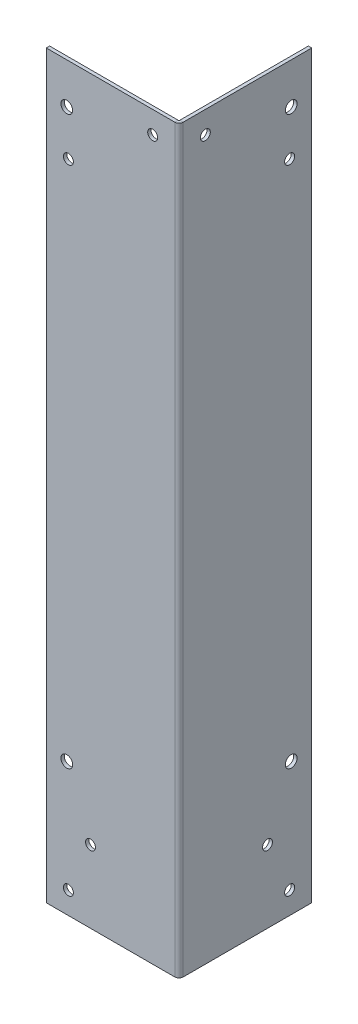
ISO-10303-21;
HEADER;
FILE_DESCRIPTION(('STEP AP214'),'2;1');
FILE_NAME('part.step','',(''),(''),'','','');
FILE_SCHEMA(('AUTOMOTIVE_DESIGN { 1 0 10303 214 1 1 1 1 }'));
ENDSEC;
DATA;
#1=APPLICATION_CONTEXT('core data for automotive mechanical design processes');
#2=APPLICATION_PROTOCOL_DEFINITION('international standard','automotive_design',2000,#1);
#3=PRODUCT_CONTEXT('',#1,'mechanical');
#4=PRODUCT('Part','Part','',(#3));
#5=PRODUCT_RELATED_PRODUCT_CATEGORY('part','',(#4));
#6=PRODUCT_DEFINITION_FORMATION('','',#4);
#7=PRODUCT_DEFINITION_CONTEXT('part definition',#1,'design');
#8=PRODUCT_DEFINITION('design','',#6,#7);
#9=PRODUCT_DEFINITION_SHAPE('','',#8);
#10=(LENGTH_UNIT() NAMED_UNIT(*) SI_UNIT(.MILLI.,.METRE.));
#11=(NAMED_UNIT(*) PLANE_ANGLE_UNIT() SI_UNIT($,.RADIAN.));
#12=(NAMED_UNIT(*) SI_UNIT($,.STERADIAN.) SOLID_ANGLE_UNIT());
#13=UNCERTAINTY_MEASURE_WITH_UNIT(LENGTH_MEASURE(1.E-05),#10,'distance_accuracy_value','');
#14=(GEOMETRIC_REPRESENTATION_CONTEXT(3) GLOBAL_UNCERTAINTY_ASSIGNED_CONTEXT((#13)) GLOBAL_UNIT_ASSIGNED_CONTEXT((#10,
#11,#12)) REPRESENTATION_CONTEXT('',''));
#15=CARTESIAN_POINT('',(0.,0.,0.));
#16=DIRECTION('',(0.,0.,1.));
#17=DIRECTION('',(1.,0.,0.));
#18=AXIS2_PLACEMENT_3D('',#15,#16,#17);
#19=CARTESIAN_POINT('',(-1.51892,334.61392,0.));
#20=DIRECTION('',(0.,1.,0.));
#21=DIRECTION('',(0.,0.,1.));
#22=AXIS2_PLACEMENT_3D('',#19,#20,#21);
#23=PLANE('',#22);
#24=DIRECTION('',(0.,0.,1.));
#25=VECTOR('',#24,1.);
#26=CARTESIAN_POINT('',(-1.51892,334.61392,0.));
#27=LINE('',#26,#25);
#28=CARTESIAN_POINT('',(-1.51892,334.61392,0.));
#29=VERTEX_POINT('',#28);
#30=CARTESIAN_POINT('',(-1.51891999999999,334.61392,58.10008));
#31=VERTEX_POINT('',#30);
#32=EDGE_CURVE('E118',#29,#31,#27,.T.);
#33=ORIENTED_EDGE('',*,*,#32,.T.);
#34=DIRECTION('',(1.,0.,0.));
#35=VECTOR('',#34,1.);
#36=CARTESIAN_POINT('',(-1.51891999999999,334.61392,58.10008));
#37=LINE('',#36,#35);
#38=CARTESIAN_POINT('',(0.,334.61392,58.10008));
#39=VERTEX_POINT('',#38);
#40=EDGE_CURVE('E114',#31,#39,#37,.T.);
#41=ORIENTED_EDGE('',*,*,#40,.T.);
#42=DIRECTION('',(0.,0.,1.));
#43=VECTOR('',#42,1.);
#44=CARTESIAN_POINT('',(0.,334.61392,0.));
#45=LINE('',#44,#43);
#46=CARTESIAN_POINT('',(0.,334.61392,0.));
#47=VERTEX_POINT('',#46);
#48=EDGE_CURVE('E104',#47,#39,#45,.T.);
#49=ORIENTED_EDGE('',*,*,#48,.F.);
#50=DIRECTION('',(1.,0.,0.));
#51=VECTOR('',#50,1.);
#52=CARTESIAN_POINT('',(-1.51892,334.61392,0.));
#53=LINE('',#52,#51);
#54=EDGE_CURVE('E63',#29,#47,#53,.T.);
#55=ORIENTED_EDGE('',*,*,#54,.F.);
#56=EDGE_LOOP('',(#33,#41,#49,#55));
#57=FACE_BOUND('',#56,.T.);
#58=ADVANCED_FACE('F59',(#57),#23,.T.);
#59=CARTESIAN_POINT('',(-1.51892,0.,0.));
#60=DIRECTION('',(1.,0.,0.));
#61=DIRECTION('',(0.,0.,-1.));
#62=AXIS2_PLACEMENT_3D('',#59,#60,#61);
#63=PLANE('',#62);
#64=CARTESIAN_POINT('',(-1.51892,296.132840000001,10.));
#65=DIRECTION('',(1.,0.,0.));
#66=DIRECTION('',(0.,0.,-1.));
#67=AXIS2_PLACEMENT_3D('',#64,#65,#66);
#68=CIRCLE('',#67,2.24999999999997);
#69=CARTESIAN_POINT('',(-1.51892,296.132840000001,7.75000000000003));
#70=VERTEX_POINT('',#69);
#71=EDGE_CURVE('E239',#70,#70,#68,.T.);
#72=ORIENTED_EDGE('',*,*,#71,.T.);
#73=EDGE_LOOP('',(#72));
#74=FACE_BOUND('',#73,.T.);
#75=CARTESIAN_POINT('',(-1.51892,324.61392,48.10008));
#76=DIRECTION('',(1.,0.,0.));
#77=DIRECTION('',(0.,0.,-1.));
#78=AXIS2_PLACEMENT_3D('',#75,#76,#77);
#79=CIRCLE('',#78,2.24999999999997);
#80=CARTESIAN_POINT('',(-1.51892,324.61392,45.85008));
#81=VERTEX_POINT('',#80);
#82=EDGE_CURVE('E233',#81,#81,#79,.T.);
#83=ORIENTED_EDGE('',*,*,#82,.T.);
#84=EDGE_LOOP('',(#83));
#85=FACE_BOUND('',#84,.T.);
#86=CARTESIAN_POINT('',(-1.51892,10.,10.));
#87=DIRECTION('',(1.,0.,0.));
#88=DIRECTION('',(0.,0.,-1.));
#89=AXIS2_PLACEMENT_3D('',#86,#87,#88);
#90=CIRCLE('',#89,2.24999999999999);
#91=CARTESIAN_POINT('',(-1.51892,10.,7.75000000000001));
#92=VERTEX_POINT('',#91);
#93=EDGE_CURVE('E227',#92,#92,#90,.T.);
#94=ORIENTED_EDGE('',*,*,#93,.T.);
#95=EDGE_LOOP('',(#94));
#96=FACE_BOUND('',#95,.T.);
#97=CARTESIAN_POINT('',(-1.51892,32.7140000000022,20.));
#98=DIRECTION('',(1.,0.,0.));
#99=DIRECTION('',(0.,0.,-1.));
#100=AXIS2_PLACEMENT_3D('',#97,#98,#99);
#101=CIRCLE('',#100,2.24999999999999);
#102=CARTESIAN_POINT('',(-1.51892,32.7140000000022,17.75));
#103=VERTEX_POINT('',#102);
#104=EDGE_CURVE('E221',#103,#103,#101,.T.);
#105=ORIENTED_EDGE('',*,*,#104,.T.);
#106=EDGE_LOOP('',(#105));
#107=FACE_BOUND('',#106,.T.);
#108=CARTESIAN_POINT('',(-1.51892,60.,9.273973));
#109=DIRECTION('',(1.,0.,0.));
#110=DIRECTION('',(0.,0.,-1.));
#111=AXIS2_PLACEMENT_3D('',#108,#109,#110);
#112=CIRCLE('',#111,2.64999999999999);
#113=CARTESIAN_POINT('',(-1.51892,60.,6.62397300000001));
#114=VERTEX_POINT('',#113);
#115=EDGE_CURVE('E191',#114,#114,#112,.T.);
#116=ORIENTED_EDGE('',*,*,#115,.T.);
#117=EDGE_LOOP('',(#116));
#118=FACE_BOUND('',#117,.T.);
#119=CARTESIAN_POINT('',(-1.51892,316.13284,9.273973));
#120=DIRECTION('',(1.,0.,0.));
#121=DIRECTION('',(0.,0.,-1.));
#122=AXIS2_PLACEMENT_3D('',#119,#120,#121);
#123=CIRCLE('',#122,2.64999999999999);
#124=CARTESIAN_POINT('',(-1.51892,316.13284,6.62397300000001));
#125=VERTEX_POINT('',#124);
#126=EDGE_CURVE('E185',#125,#125,#123,.T.);
#127=ORIENTED_EDGE('',*,*,#126,.T.);
#128=EDGE_LOOP('',(#127));
#129=FACE_BOUND('',#128,.T.);
#130=DIRECTION('',(0.,1.,0.));
#131=VECTOR('',#130,1.);
#132=CARTESIAN_POINT('',(-1.51891999999999,334.61392,58.10008));
#133=LINE('',#132,#131);
#134=CARTESIAN_POINT('',(-1.51891999999999,0.,58.10008));
#135=VERTEX_POINT('',#134);
#136=EDGE_CURVE('E127',#31,#135,#133,.F.);
#137=ORIENTED_EDGE('',*,*,#136,.F.);
#138=ORIENTED_EDGE('',*,*,#32,.F.);
#139=DIRECTION('',(0.,1.,0.));
#140=VECTOR('',#139,1.);
#141=CARTESIAN_POINT('',(-1.51892,0.,0.));
#142=LINE('',#141,#140);
#143=CARTESIAN_POINT('',(-1.51892,0.,0.));
#144=VERTEX_POINT('',#143);
#145=EDGE_CURVE('E103',#144,#29,#142,.T.);
#146=ORIENTED_EDGE('',*,*,#145,.F.);
#147=DIRECTION('',(0.,0.,-1.));
#148=VECTOR('',#147,1.);
#149=CARTESIAN_POINT('',(-1.51892,0.,0.));
#150=LINE('',#149,#148);
#151=EDGE_CURVE('E82',#135,#144,#150,.T.);
#152=ORIENTED_EDGE('',*,*,#151,.F.);
#153=EDGE_LOOP('',(#137,#138,#146,#152));
#154=FACE_BOUND('',#153,.T.);
#155=ADVANCED_FACE('F251',(#74,#85,#96,#107,#118,#129,#154),#63,.F.);
#156=CARTESIAN_POINT('',(0.,0.,0.));
#157=DIRECTION('',(1.,0.,0.));
#158=DIRECTION('',(0.,0.,-1.));
#159=AXIS2_PLACEMENT_3D('',#156,#157,#158);
#160=PLANE('',#159);
#161=CARTESIAN_POINT('',(0.,296.132840000001,10.));
#162=DIRECTION('',(1.,0.,0.));
#163=DIRECTION('',(0.,0.,-1.));
#164=AXIS2_PLACEMENT_3D('',#161,#162,#163);
#165=CIRCLE('',#164,2.24999999999997);
#166=CARTESIAN_POINT('',(0.,296.132840000001,7.75000000000003));
#167=VERTEX_POINT('',#166);
#168=EDGE_CURVE('E242',#167,#167,#165,.T.);
#169=ORIENTED_EDGE('',*,*,#168,.F.);
#170=EDGE_LOOP('',(#169));
#171=FACE_BOUND('',#170,.T.);
#172=CARTESIAN_POINT('',(0.,324.61392,48.10008));
#173=DIRECTION('',(1.,0.,0.));
#174=DIRECTION('',(0.,0.,-1.));
#175=AXIS2_PLACEMENT_3D('',#172,#173,#174);
#176=CIRCLE('',#175,2.24999999999997);
#177=CARTESIAN_POINT('',(0.,324.61392,45.85008));
#178=VERTEX_POINT('',#177);
#179=EDGE_CURVE('E236',#178,#178,#176,.T.);
#180=ORIENTED_EDGE('',*,*,#179,.F.);
#181=EDGE_LOOP('',(#180));
#182=FACE_BOUND('',#181,.T.);
#183=CARTESIAN_POINT('',(0.,10.,10.));
#184=DIRECTION('',(1.,0.,0.));
#185=DIRECTION('',(0.,0.,-1.));
#186=AXIS2_PLACEMENT_3D('',#183,#184,#185);
#187=CIRCLE('',#186,2.24999999999999);
#188=CARTESIAN_POINT('',(0.,10.,7.75000000000001));
#189=VERTEX_POINT('',#188);
#190=EDGE_CURVE('E230',#189,#189,#187,.T.);
#191=ORIENTED_EDGE('',*,*,#190,.F.);
#192=EDGE_LOOP('',(#191));
#193=FACE_BOUND('',#192,.T.);
#194=CARTESIAN_POINT('',(0.,32.7140000000022,20.));
#195=DIRECTION('',(1.,0.,0.));
#196=DIRECTION('',(0.,0.,-1.));
#197=AXIS2_PLACEMENT_3D('',#194,#195,#196);
#198=CIRCLE('',#197,2.24999999999999);
#199=CARTESIAN_POINT('',(0.,32.7140000000022,17.75));
#200=VERTEX_POINT('',#199);
#201=EDGE_CURVE('E224',#200,#200,#198,.T.);
#202=ORIENTED_EDGE('',*,*,#201,.F.);
#203=EDGE_LOOP('',(#202));
#204=FACE_BOUND('',#203,.T.);
#205=CARTESIAN_POINT('',(0.,60.,9.273973));
#206=DIRECTION('',(1.,0.,0.));
#207=DIRECTION('',(0.,0.,-1.));
#208=AXIS2_PLACEMENT_3D('',#205,#206,#207);
#209=CIRCLE('',#208,2.64999999999999);
#210=CARTESIAN_POINT('',(0.,60.,6.62397300000001));
#211=VERTEX_POINT('',#210);
#212=EDGE_CURVE('E194',#211,#211,#209,.T.);
#213=ORIENTED_EDGE('',*,*,#212,.F.);
#214=EDGE_LOOP('',(#213));
#215=FACE_BOUND('',#214,.T.);
#216=CARTESIAN_POINT('',(0.,316.13284,9.273973));
#217=DIRECTION('',(1.,0.,0.));
#218=DIRECTION('',(0.,0.,-1.));
#219=AXIS2_PLACEMENT_3D('',#216,#217,#218);
#220=CIRCLE('',#219,2.64999999999999);
#221=CARTESIAN_POINT('',(0.,316.13284,6.62397300000001));
#222=VERTEX_POINT('',#221);
#223=EDGE_CURVE('E188',#222,#222,#220,.T.);
#224=ORIENTED_EDGE('',*,*,#223,.F.);
#225=EDGE_LOOP('',(#224));
#226=FACE_BOUND('',#225,.T.);
#227=ORIENTED_EDGE('',*,*,#48,.T.);
#228=DIRECTION('',(0.,1.,0.));
#229=VECTOR('',#228,1.);
#230=CARTESIAN_POINT('',(0.,334.61392,58.10008));
#231=LINE('',#230,#229);
#232=CARTESIAN_POINT('',(0.,0.,58.10008));
#233=VERTEX_POINT('',#232);
#234=EDGE_CURVE('E102',#39,#233,#231,.F.);
#235=ORIENTED_EDGE('',*,*,#234,.T.);
#236=DIRECTION('',(0.,0.,-1.));
#237=VECTOR('',#236,1.);
#238=CARTESIAN_POINT('',(0.,0.,0.));
#239=LINE('',#238,#237);
#240=CARTESIAN_POINT('',(0.,0.,0.));
#241=VERTEX_POINT('',#240);
#242=EDGE_CURVE('E97',#233,#241,#239,.T.);
#243=ORIENTED_EDGE('',*,*,#242,.T.);
#244=DIRECTION('',(0.,1.,0.));
#245=VECTOR('',#244,1.);
#246=CARTESIAN_POINT('',(0.,0.,0.));
#247=LINE('',#246,#245);
#248=EDGE_CURVE('E101',#241,#47,#247,.T.);
#249=ORIENTED_EDGE('',*,*,#248,.T.);
#250=EDGE_LOOP('',(#227,#235,#243,#249));
#251=FACE_BOUND('',#250,.T.);
#252=ADVANCED_FACE('F99',(#171,#182,#193,#204,#215,#226,#251),#160,.T.);
#253=CARTESIAN_POINT('',(-1.51892,0.,0.));
#254=DIRECTION('',(0.,0.,-1.));
#255=DIRECTION('',(-1.,0.,0.));
#256=AXIS2_PLACEMENT_3D('',#253,#254,#255);
#257=PLANE('',#256);
#258=ORIENTED_EDGE('',*,*,#248,.F.);
#259=DIRECTION('',(1.,0.,0.));
#260=VECTOR('',#259,1.);
#261=CARTESIAN_POINT('',(-1.51892,0.,0.));
#262=LINE('',#261,#260);
#263=EDGE_CURVE('E13',#144,#241,#262,.T.);
#264=ORIENTED_EDGE('',*,*,#263,.F.);
#265=ORIENTED_EDGE('',*,*,#145,.T.);
#266=ORIENTED_EDGE('',*,*,#54,.T.);
#267=EDGE_LOOP('',(#258,#264,#265,#266));
#268=FACE_BOUND('',#267,.T.);
#269=ADVANCED_FACE('F61',(#268),#257,.T.);
#270=CARTESIAN_POINT('',(-1.51892,0.,0.));
#271=DIRECTION('',(0.,-1.,0.));
#272=DIRECTION('',(0.,0.,-1.));
#273=AXIS2_PLACEMENT_3D('',#270,#271,#272);
#274=PLANE('',#273);
#275=DIRECTION('',(1.,0.,0.));
#276=VECTOR('',#275,1.);
#277=CARTESIAN_POINT('',(-1.51891999999999,0.,58.10008));
#278=LINE('',#277,#276);
#279=EDGE_CURVE('E111',#135,#233,#278,.T.);
#280=ORIENTED_EDGE('',*,*,#279,.F.);
#281=ORIENTED_EDGE('',*,*,#151,.T.);
#282=ORIENTED_EDGE('',*,*,#263,.T.);
#283=ORIENTED_EDGE('',*,*,#242,.F.);
#284=EDGE_LOOP('',(#280,#281,#282,#283));
#285=FACE_BOUND('',#284,.T.);
#286=ADVANCED_FACE('F106',(#285),#274,.T.);
#287=CARTESIAN_POINT('',(-1.89991999999999,0.,58.10008));
#288=DIRECTION('',(0.,-1.,0.));
#289=DIRECTION('',(0.,0.,-1.));
#290=AXIS2_PLACEMENT_3D('',#287,#288,#289);
#291=PLANE('',#290);
#292=DIRECTION('',(0.,0.,-1.));
#293=VECTOR('',#292,1.);
#294=CARTESIAN_POINT('',(-1.89992,0.,60.));
#295=LINE('',#294,#293);
#296=CARTESIAN_POINT('',(-1.89991999999999,0.,58.48108));
#297=VERTEX_POINT('',#296);
#298=CARTESIAN_POINT('',(-1.89991999999999,0.,60.));
#299=VERTEX_POINT('',#298);
#300=EDGE_CURVE('E139',#297,#299,#295,.F.);
#301=ORIENTED_EDGE('',*,*,#300,.F.);
#302=CARTESIAN_POINT('',(-1.89991999999999,0.,58.10008));
#303=DIRECTION('',(0.,1.,0.));
#304=DIRECTION('',(0.,0.,1.));
#305=AXIS2_PLACEMENT_3D('',#302,#303,#304);
#306=CIRCLE('',#305,0.380999999999999);
#307=EDGE_CURVE('E131',#135,#297,#306,.F.);
#308=ORIENTED_EDGE('',*,*,#307,.F.);
#309=ORIENTED_EDGE('',*,*,#279,.T.);
#310=CARTESIAN_POINT('',(-1.89991999999999,0.,58.10008));
#311=DIRECTION('',(0.,1.,0.));
#312=DIRECTION('',(0.,0.,1.));
#313=AXIS2_PLACEMENT_3D('',#310,#311,#312);
#314=CIRCLE('',#313,1.89992);
#315=EDGE_CURVE('E74',#233,#299,#314,.F.);
#316=ORIENTED_EDGE('',*,*,#315,.T.);
#317=EDGE_LOOP('',(#301,#308,#309,#316));
#318=FACE_BOUND('',#317,.T.);
#319=ADVANCED_FACE('F326',(#318),#291,.T.);
#320=CARTESIAN_POINT('',(-1.89991999999999,334.61392,58.10008));
#321=DIRECTION('',(0.,-1.,0.));
#322=DIRECTION('',(0.,0.,-1.));
#323=AXIS2_PLACEMENT_3D('',#320,#321,#322);
#324=PLANE('',#323);
#325=CARTESIAN_POINT('',(-1.89991999999999,334.61392,58.10008));
#326=DIRECTION('',(0.,1.,0.));
#327=DIRECTION('',(0.,0.,1.));
#328=AXIS2_PLACEMENT_3D('',#325,#326,#327);
#329=CIRCLE('',#328,0.380999999999999);
#330=CARTESIAN_POINT('',(-1.89991999999999,334.61392,58.48108));
#331=VERTEX_POINT('',#330);
#332=EDGE_CURVE('E124',#331,#31,#329,.T.);
#333=ORIENTED_EDGE('',*,*,#332,.F.);
#334=DIRECTION('',(0.,0.,-1.));
#335=VECTOR('',#334,1.);
#336=CARTESIAN_POINT('',(-1.89991999999999,334.61392,58.48108));
#337=LINE('',#336,#335);
#338=CARTESIAN_POINT('',(-1.89991999999999,334.61392,60.));
#339=VERTEX_POINT('',#338);
#340=EDGE_CURVE('E146',#331,#339,#337,.F.);
#341=ORIENTED_EDGE('',*,*,#340,.T.);
#342=CARTESIAN_POINT('',(-1.89991999999999,334.61392,58.10008));
#343=DIRECTION('',(0.,1.,0.));
#344=DIRECTION('',(0.,0.,1.));
#345=AXIS2_PLACEMENT_3D('',#342,#343,#344);
#346=CIRCLE('',#345,1.89992);
#347=EDGE_CURVE('E134',#339,#39,#346,.T.);
#348=ORIENTED_EDGE('',*,*,#347,.T.);
#349=ORIENTED_EDGE('',*,*,#40,.F.);
#350=EDGE_LOOP('',(#333,#341,#348,#349));
#351=FACE_BOUND('',#350,.T.);
#352=ADVANCED_FACE('F303',(#351),#324,.F.);
#353=CARTESIAN_POINT('',(-1.89991999999999,334.61392,58.10008));
#354=DIRECTION('',(0.,1.,0.));
#355=DIRECTION('',(0.,0.,1.));
#356=AXIS2_PLACEMENT_3D('',#353,#354,#355);
#357=CYLINDRICAL_SURFACE('',#356,1.89992);
#358=ORIENTED_EDGE('',*,*,#234,.F.);
#359=ORIENTED_EDGE('',*,*,#347,.F.);
#360=DIRECTION('',(0.,1.,0.));
#361=VECTOR('',#360,1.);
#362=CARTESIAN_POINT('',(-1.89992,0.,60.));
#363=LINE('',#362,#361);
#364=EDGE_CURVE('E149',#339,#299,#363,.F.);
#365=ORIENTED_EDGE('',*,*,#364,.T.);
#366=ORIENTED_EDGE('',*,*,#315,.F.);
#367=EDGE_LOOP('',(#358,#359,#365,#366));
#368=FACE_BOUND('',#367,.T.);
#369=ADVANCED_FACE('F324',(#368),#357,.T.);
#370=CARTESIAN_POINT('',(-1.89991999999999,334.61392,58.10008));
#371=DIRECTION('',(0.,1.,0.));
#372=DIRECTION('',(0.,0.,1.));
#373=AXIS2_PLACEMENT_3D('',#370,#371,#372);
#374=CYLINDRICAL_SURFACE('',#373,0.380999999999999);
#375=ORIENTED_EDGE('',*,*,#136,.T.);
#376=ORIENTED_EDGE('',*,*,#307,.T.);
#377=DIRECTION('',(0.,1.,0.));
#378=VECTOR('',#377,1.);
#379=CARTESIAN_POINT('',(-1.89992,0.,58.48108));
#380=LINE('',#379,#378);
#381=EDGE_CURVE('E142',#297,#331,#380,.T.);
#382=ORIENTED_EDGE('',*,*,#381,.T.);
#383=ORIENTED_EDGE('',*,*,#332,.T.);
#384=EDGE_LOOP('',(#375,#376,#382,#383));
#385=FACE_BOUND('',#384,.T.);
#386=ADVANCED_FACE('F297',(#385),#374,.F.);
#387=CARTESIAN_POINT('',(-60.,334.61392,60.0000000000002));
#388=DIRECTION('',(0.,-1.,0.));
#389=DIRECTION('',(0.,0.,-1.));
#390=AXIS2_PLACEMENT_3D('',#387,#388,#389);
#391=PLANE('',#390);
#392=ORIENTED_EDGE('',*,*,#340,.F.);
#393=DIRECTION('',(1.,0.,0.));
#394=VECTOR('',#393,1.);
#395=CARTESIAN_POINT('',(-60.,334.61392,58.4810800000002));
#396=LINE('',#395,#394);
#397=CARTESIAN_POINT('',(-60.,334.61392,58.4810800000002));
#398=VERTEX_POINT('',#397);
#399=EDGE_CURVE('E151',#331,#398,#396,.F.);
#400=ORIENTED_EDGE('',*,*,#399,.T.);
#401=DIRECTION('',(0.,0.,-1.));
#402=VECTOR('',#401,1.);
#403=CARTESIAN_POINT('',(-60.,334.61392,60.0000000000002));
#404=LINE('',#403,#402);
#405=CARTESIAN_POINT('',(-60.,334.61392,60.0000000000002));
#406=VERTEX_POINT('',#405);
#407=EDGE_CURVE('E128',#406,#398,#404,.T.);
#408=ORIENTED_EDGE('',*,*,#407,.F.);
#409=DIRECTION('',(-1.,0.,0.));
#410=VECTOR('',#409,1.);
#411=CARTESIAN_POINT('',(2.11757665617395E-13,334.61392,60.));
#412=LINE('',#411,#410);
#413=EDGE_CURVE('E160',#339,#406,#412,.T.);
#414=ORIENTED_EDGE('',*,*,#413,.F.);
#415=EDGE_LOOP('',(#392,#400,#408,#414));
#416=FACE_BOUND('',#415,.T.);
#417=ADVANCED_FACE('F308',(#416),#391,.F.);
#418=CARTESIAN_POINT('',(-1.51891999999999,0.,60.));
#419=DIRECTION('',(0.,1.,0.));
#420=DIRECTION('',(0.,0.,1.));
#421=AXIS2_PLACEMENT_3D('',#418,#419,#420);
#422=PLANE('',#421);
#423=ORIENTED_EDGE('',*,*,#300,.T.);
#424=DIRECTION('',(1.,0.,0.));
#425=VECTOR('',#424,1.);
#426=CARTESIAN_POINT('',(2.11757665617395E-13,0.,60.));
#427=LINE('',#426,#425);
#428=CARTESIAN_POINT('',(-60.,0.,60.0000000000002));
#429=VERTEX_POINT('',#428);
#430=EDGE_CURVE('E166',#429,#299,#427,.T.);
#431=ORIENTED_EDGE('',*,*,#430,.F.);
#432=DIRECTION('',(0.,0.,-1.));
#433=VECTOR('',#432,1.);
#434=CARTESIAN_POINT('',(-60.,0.,60.0000000000002));
#435=LINE('',#434,#433);
#436=CARTESIAN_POINT('',(-60.,0.,58.4810800000002));
#437=VERTEX_POINT('',#436);
#438=EDGE_CURVE('E169',#429,#437,#435,.T.);
#439=ORIENTED_EDGE('',*,*,#438,.T.);
#440=DIRECTION('',(-1.,0.,0.));
#441=VECTOR('',#440,1.);
#442=CARTESIAN_POINT('',(-1.51892,0.,58.48108));
#443=LINE('',#442,#441);
#444=EDGE_CURVE('E157',#437,#297,#443,.F.);
#445=ORIENTED_EDGE('',*,*,#444,.T.);
#446=EDGE_LOOP('',(#423,#431,#439,#445));
#447=FACE_BOUND('',#446,.T.);
#448=ADVANCED_FACE('F329',(#447),#422,.F.);
#449=CARTESIAN_POINT('',(2.11757665617395E-13,0.,60.));
#450=DIRECTION('',(0.,0.,-1.));
#451=DIRECTION('',(-1.,0.,0.));
#452=AXIS2_PLACEMENT_3D('',#449,#450,#451);
#453=PLANE('',#452);
#454=CARTESIAN_POINT('',(-50.,296.132840000001,60.));
#455=DIRECTION('',(0.,0.,1.));
#456=DIRECTION('',(1.,0.,0.));
#457=AXIS2_PLACEMENT_3D('',#454,#455,#456);
#458=CIRCLE('',#457,2.24999999999999);
#459=CARTESIAN_POINT('',(-47.75,296.132840000001,60.));
#460=VERTEX_POINT('',#459);
#461=EDGE_CURVE('E218',#460,#460,#458,.T.);
#462=ORIENTED_EDGE('',*,*,#461,.F.);
#463=EDGE_LOOP('',(#462));
#464=FACE_BOUND('',#463,.T.);
#465=CARTESIAN_POINT('',(-11.89992,324.61392,60.));
#466=DIRECTION('',(0.,0.,1.));
#467=DIRECTION('',(1.,0.,0.));
#468=AXIS2_PLACEMENT_3D('',#465,#466,#467);
#469=CIRCLE('',#468,2.24999999999999);
#470=CARTESIAN_POINT('',(-9.64992000000001,324.61392,60.));
#471=VERTEX_POINT('',#470);
#472=EDGE_CURVE('E212',#471,#471,#469,.T.);
#473=ORIENTED_EDGE('',*,*,#472,.F.);
#474=EDGE_LOOP('',(#473));
#475=FACE_BOUND('',#474,.T.);
#476=CARTESIAN_POINT('',(-50.,10.,60.));
#477=DIRECTION('',(0.,0.,1.));
#478=DIRECTION('',(1.,0.,0.));
#479=AXIS2_PLACEMENT_3D('',#476,#477,#478);
#480=CIRCLE('',#479,2.24999999999999);
#481=CARTESIAN_POINT('',(-47.75,10.,60.));
#482=VERTEX_POINT('',#481);
#483=EDGE_CURVE('E206',#482,#482,#480,.T.);
#484=ORIENTED_EDGE('',*,*,#483,.F.);
#485=EDGE_LOOP('',(#484));
#486=FACE_BOUND('',#485,.T.);
#487=CARTESIAN_POINT('',(-40.,32.7140000000021,60.));
#488=DIRECTION('',(0.,0.,1.));
#489=DIRECTION('',(1.,0.,0.));
#490=AXIS2_PLACEMENT_3D('',#487,#488,#489);
#491=CIRCLE('',#490,2.24999999999999);
#492=CARTESIAN_POINT('',(-37.75,32.7140000000021,60.));
#493=VERTEX_POINT('',#492);
#494=EDGE_CURVE('E200',#493,#493,#491,.T.);
#495=ORIENTED_EDGE('',*,*,#494,.F.);
#496=EDGE_LOOP('',(#495));
#497=FACE_BOUND('',#496,.T.);
#498=CARTESIAN_POINT('',(-50.726027,60.,60.));
#499=DIRECTION('',(0.,0.,1.));
#500=DIRECTION('',(1.,0.,0.));
#501=AXIS2_PLACEMENT_3D('',#498,#499,#500);
#502=CIRCLE('',#501,2.64999999999999);
#503=CARTESIAN_POINT('',(-48.076027,60.,60.));
#504=VERTEX_POINT('',#503);
#505=EDGE_CURVE('E182',#504,#504,#502,.T.);
#506=ORIENTED_EDGE('',*,*,#505,.F.);
#507=EDGE_LOOP('',(#506));
#508=FACE_BOUND('',#507,.T.);
#509=CARTESIAN_POINT('',(-50.726027,316.13284,60.));
#510=DIRECTION('',(0.,0.,1.));
#511=DIRECTION('',(1.,0.,0.));
#512=AXIS2_PLACEMENT_3D('',#509,#510,#511);
#513=CIRCLE('',#512,2.64999999999999);
#514=CARTESIAN_POINT('',(-48.076027,316.13284,60.));
#515=VERTEX_POINT('',#514);
#516=EDGE_CURVE('E176',#515,#515,#513,.T.);
#517=ORIENTED_EDGE('',*,*,#516,.F.);
#518=EDGE_LOOP('',(#517));
#519=FACE_BOUND('',#518,.T.);
#520=ORIENTED_EDGE('',*,*,#364,.F.);
#521=ORIENTED_EDGE('',*,*,#413,.T.);
#522=DIRECTION('',(0.,-1.,0.));
#523=VECTOR('',#522,1.);
#524=CARTESIAN_POINT('',(-60.,0.,60.0000000000002));
#525=LINE('',#524,#523);
#526=EDGE_CURVE('E163',#406,#429,#525,.T.);
#527=ORIENTED_EDGE('',*,*,#526,.T.);
#528=ORIENTED_EDGE('',*,*,#430,.T.);
#529=EDGE_LOOP('',(#520,#521,#527,#528));
#530=FACE_BOUND('',#529,.T.);
#531=ADVANCED_FACE('F330',(#464,#475,#486,#497,#508,#519,#530),#453,.F.);
#532=CARTESIAN_POINT('',(2.06454384782199E-13,0.,58.48108));
#533=DIRECTION('',(0.,0.,-1.));
#534=DIRECTION('',(-1.,0.,0.));
#535=AXIS2_PLACEMENT_3D('',#532,#533,#534);
#536=PLANE('',#535);
#537=CARTESIAN_POINT('',(-50.,296.132840000001,58.4810800000002));
#538=DIRECTION('',(0.,0.,-1.));
#539=DIRECTION('',(-1.,0.,0.));
#540=AXIS2_PLACEMENT_3D('',#537,#538,#539);
#541=CIRCLE('',#540,2.24999999999999);
#542=CARTESIAN_POINT('',(-52.25,296.132840000001,58.4810800000002));
#543=VERTEX_POINT('',#542);
#544=EDGE_CURVE('E215',#543,#543,#541,.T.);
#545=ORIENTED_EDGE('',*,*,#544,.F.);
#546=EDGE_LOOP('',(#545));
#547=FACE_BOUND('',#546,.T.);
#548=CARTESIAN_POINT('',(-11.89992,324.61392,58.48108));
#549=DIRECTION('',(0.,0.,-1.));
#550=DIRECTION('',(-1.,0.,0.));
#551=AXIS2_PLACEMENT_3D('',#548,#549,#550);
#552=CIRCLE('',#551,2.24999999999999);
#553=CARTESIAN_POINT('',(-14.14992,324.61392,58.48108));
#554=VERTEX_POINT('',#553);
#555=EDGE_CURVE('E209',#554,#554,#552,.T.);
#556=ORIENTED_EDGE('',*,*,#555,.F.);
#557=EDGE_LOOP('',(#556));
#558=FACE_BOUND('',#557,.T.);
#559=CARTESIAN_POINT('',(-50.,10.,58.4810800000002));
#560=DIRECTION('',(0.,0.,-1.));
#561=DIRECTION('',(-1.,0.,0.));
#562=AXIS2_PLACEMENT_3D('',#559,#560,#561);
#563=CIRCLE('',#562,2.24999999999999);
#564=CARTESIAN_POINT('',(-52.25,10.,58.4810800000002));
#565=VERTEX_POINT('',#564);
#566=EDGE_CURVE('E203',#565,#565,#563,.T.);
#567=ORIENTED_EDGE('',*,*,#566,.F.);
#568=EDGE_LOOP('',(#567));
#569=FACE_BOUND('',#568,.T.);
#570=CARTESIAN_POINT('',(-40.,32.7140000000021,58.4810800000001));
#571=DIRECTION('',(0.,0.,-1.));
#572=DIRECTION('',(-1.,0.,0.));
#573=AXIS2_PLACEMENT_3D('',#570,#571,#572);
#574=CIRCLE('',#573,2.24999999999999);
#575=CARTESIAN_POINT('',(-42.25,32.7140000000021,58.4810800000001));
#576=VERTEX_POINT('',#575);
#577=EDGE_CURVE('E197',#576,#576,#574,.T.);
#578=ORIENTED_EDGE('',*,*,#577,.F.);
#579=EDGE_LOOP('',(#578));
#580=FACE_BOUND('',#579,.T.);
#581=CARTESIAN_POINT('',(-50.726027,60.,58.4810800000002));
#582=DIRECTION('',(0.,0.,-1.));
#583=DIRECTION('',(-1.,0.,0.));
#584=AXIS2_PLACEMENT_3D('',#581,#582,#583);
#585=CIRCLE('',#584,2.64999999999999);
#586=CARTESIAN_POINT('',(-53.376027,60.,58.4810800000002));
#587=VERTEX_POINT('',#586);
#588=EDGE_CURVE('E179',#587,#587,#585,.T.);
#589=ORIENTED_EDGE('',*,*,#588,.F.);
#590=EDGE_LOOP('',(#589));
#591=FACE_BOUND('',#590,.T.);
#592=CARTESIAN_POINT('',(-50.726027,316.13284,58.4810800000002));
#593=DIRECTION('',(0.,0.,-1.));
#594=DIRECTION('',(-1.,0.,0.));
#595=AXIS2_PLACEMENT_3D('',#592,#593,#594);
#596=CIRCLE('',#595,2.64999999999999);
#597=CARTESIAN_POINT('',(-53.376027,316.13284,58.4810800000002));
#598=VERTEX_POINT('',#597);
#599=EDGE_CURVE('E143',#598,#598,#596,.T.);
#600=ORIENTED_EDGE('',*,*,#599,.F.);
#601=EDGE_LOOP('',(#600));
#602=FACE_BOUND('',#601,.T.);
#603=ORIENTED_EDGE('',*,*,#399,.F.);
#604=ORIENTED_EDGE('',*,*,#381,.F.);
#605=ORIENTED_EDGE('',*,*,#444,.F.);
#606=DIRECTION('',(0.,1.,0.));
#607=VECTOR('',#606,1.);
#608=CARTESIAN_POINT('',(-60.,0.,58.4810800000002));
#609=LINE('',#608,#607);
#610=EDGE_CURVE('E154',#398,#437,#609,.F.);
#611=ORIENTED_EDGE('',*,*,#610,.F.);
#612=EDGE_LOOP('',(#603,#604,#605,#611));
#613=FACE_BOUND('',#612,.T.);
#614=ADVANCED_FACE('F312',(#547,#558,#569,#580,#591,#602,#613),#536,.T.);
#615=CARTESIAN_POINT('',(-60.,0.,60.0000000000002));
#616=DIRECTION('',(1.,0.,0.));
#617=DIRECTION('',(0.,0.,-1.));
#618=AXIS2_PLACEMENT_3D('',#615,#616,#617);
#619=PLANE('',#618);
#620=ORIENTED_EDGE('',*,*,#610,.T.);
#621=ORIENTED_EDGE('',*,*,#438,.F.);
#622=ORIENTED_EDGE('',*,*,#526,.F.);
#623=ORIENTED_EDGE('',*,*,#407,.T.);
#624=EDGE_LOOP('',(#620,#621,#622,#623));
#625=FACE_BOUND('',#624,.T.);
#626=ADVANCED_FACE('F318',(#625),#619,.F.);
#627=CARTESIAN_POINT('',(-50.726027,316.13284,60.));
#628=DIRECTION('',(0.,0.,1.));
#629=DIRECTION('',(1.,0.,0.));
#630=AXIS2_PLACEMENT_3D('',#627,#628,#629);
#631=CYLINDRICAL_SURFACE('',#630,2.64999999999999);
#632=ORIENTED_EDGE('',*,*,#599,.T.);
#633=EDGE_LOOP('',(#632));
#634=FACE_BOUND('',#633,.T.);
#635=ORIENTED_EDGE('',*,*,#516,.T.);
#636=EDGE_LOOP('',(#635));
#637=FACE_BOUND('',#636,.T.);
#638=ADVANCED_FACE('F361',(#634,#637),#631,.F.);
#639=CARTESIAN_POINT('',(-50.726027,60.,60.));
#640=DIRECTION('',(0.,0.,1.));
#641=DIRECTION('',(1.,0.,0.));
#642=AXIS2_PLACEMENT_3D('',#639,#640,#641);
#643=CYLINDRICAL_SURFACE('',#642,2.64999999999999);
#644=ORIENTED_EDGE('',*,*,#588,.T.);
#645=EDGE_LOOP('',(#644));
#646=FACE_BOUND('',#645,.T.);
#647=ORIENTED_EDGE('',*,*,#505,.T.);
#648=EDGE_LOOP('',(#647));
#649=FACE_BOUND('',#648,.T.);
#650=ADVANCED_FACE('F267',(#646,#649),#643,.F.);
#651=CARTESIAN_POINT('',(0.,316.13284,9.273973));
#652=DIRECTION('',(1.,0.,0.));
#653=DIRECTION('',(0.,0.,-1.));
#654=AXIS2_PLACEMENT_3D('',#651,#652,#653);
#655=CYLINDRICAL_SURFACE('',#654,2.64999999999999);
#656=ORIENTED_EDGE('',*,*,#223,.T.);
#657=EDGE_LOOP('',(#656));
#658=FACE_BOUND('',#657,.T.);
#659=ORIENTED_EDGE('',*,*,#126,.F.);
#660=EDGE_LOOP('',(#659));
#661=FACE_BOUND('',#660,.T.);
#662=ADVANCED_FACE('F263',(#658,#661),#655,.F.);
#663=CARTESIAN_POINT('',(0.,60.,9.273973));
#664=DIRECTION('',(1.,0.,0.));
#665=DIRECTION('',(0.,0.,-1.));
#666=AXIS2_PLACEMENT_3D('',#663,#664,#665);
#667=CYLINDRICAL_SURFACE('',#666,2.64999999999999);
#668=ORIENTED_EDGE('',*,*,#212,.T.);
#669=EDGE_LOOP('',(#668));
#670=FACE_BOUND('',#669,.T.);
#671=ORIENTED_EDGE('',*,*,#115,.F.);
#672=EDGE_LOOP('',(#671));
#673=FACE_BOUND('',#672,.T.);
#674=ADVANCED_FACE('F266',(#670,#673),#667,.F.);
#675=CARTESIAN_POINT('',(-40.,32.7140000000021,60.));
#676=DIRECTION('',(0.,0.,1.));
#677=DIRECTION('',(1.,0.,0.));
#678=AXIS2_PLACEMENT_3D('',#675,#676,#677);
#679=CYLINDRICAL_SURFACE('',#678,2.24999999999999);
#680=ORIENTED_EDGE('',*,*,#577,.T.);
#681=EDGE_LOOP('',(#680));
#682=FACE_BOUND('',#681,.T.);
#683=ORIENTED_EDGE('',*,*,#494,.T.);
#684=EDGE_LOOP('',(#683));
#685=FACE_BOUND('',#684,.T.);
#686=ADVANCED_FACE('F375',(#682,#685),#679,.F.);
#687=CARTESIAN_POINT('',(-50.,10.,60.));
#688=DIRECTION('',(0.,0.,1.));
#689=DIRECTION('',(1.,0.,0.));
#690=AXIS2_PLACEMENT_3D('',#687,#688,#689);
#691=CYLINDRICAL_SURFACE('',#690,2.24999999999999);
#692=ORIENTED_EDGE('',*,*,#566,.T.);
#693=EDGE_LOOP('',(#692));
#694=FACE_BOUND('',#693,.T.);
#695=ORIENTED_EDGE('',*,*,#483,.T.);
#696=EDGE_LOOP('',(#695));
#697=FACE_BOUND('',#696,.T.);
#698=ADVANCED_FACE('F379',(#694,#697),#691,.F.);
#699=CARTESIAN_POINT('',(-11.89992,324.61392,60.));
#700=DIRECTION('',(0.,0.,1.));
#701=DIRECTION('',(1.,0.,0.));
#702=AXIS2_PLACEMENT_3D('',#699,#700,#701);
#703=CYLINDRICAL_SURFACE('',#702,2.24999999999999);
#704=ORIENTED_EDGE('',*,*,#555,.T.);
#705=EDGE_LOOP('',(#704));
#706=FACE_BOUND('',#705,.T.);
#707=ORIENTED_EDGE('',*,*,#472,.T.);
#708=EDGE_LOOP('',(#707));
#709=FACE_BOUND('',#708,.T.);
#710=ADVANCED_FACE('F383',(#706,#709),#703,.F.);
#711=CARTESIAN_POINT('',(-50.,296.132840000001,60.));
#712=DIRECTION('',(0.,0.,1.));
#713=DIRECTION('',(1.,0.,0.));
#714=AXIS2_PLACEMENT_3D('',#711,#712,#713);
#715=CYLINDRICAL_SURFACE('',#714,2.24999999999999);
#716=ORIENTED_EDGE('',*,*,#544,.T.);
#717=EDGE_LOOP('',(#716));
#718=FACE_BOUND('',#717,.T.);
#719=ORIENTED_EDGE('',*,*,#461,.T.);
#720=EDGE_LOOP('',(#719));
#721=FACE_BOUND('',#720,.T.);
#722=ADVANCED_FACE('F387',(#718,#721),#715,.F.);
#723=CARTESIAN_POINT('',(0.,32.7140000000022,20.));
#724=DIRECTION('',(1.,0.,0.));
#725=DIRECTION('',(0.,0.,-1.));
#726=AXIS2_PLACEMENT_3D('',#723,#724,#725);
#727=CYLINDRICAL_SURFACE('',#726,2.24999999999999);
#728=ORIENTED_EDGE('',*,*,#201,.T.);
#729=EDGE_LOOP('',(#728));
#730=FACE_BOUND('',#729,.T.);
#731=ORIENTED_EDGE('',*,*,#104,.F.);
#732=EDGE_LOOP('',(#731));
#733=FACE_BOUND('',#732,.T.);
#734=ADVANCED_FACE('F391',(#730,#733),#727,.F.);
#735=CARTESIAN_POINT('',(0.,10.,10.));
#736=DIRECTION('',(1.,0.,0.));
#737=DIRECTION('',(0.,0.,-1.));
#738=AXIS2_PLACEMENT_3D('',#735,#736,#737);
#739=CYLINDRICAL_SURFACE('',#738,2.24999999999999);
#740=ORIENTED_EDGE('',*,*,#190,.T.);
#741=EDGE_LOOP('',(#740));
#742=FACE_BOUND('',#741,.T.);
#743=ORIENTED_EDGE('',*,*,#93,.F.);
#744=EDGE_LOOP('',(#743));
#745=FACE_BOUND('',#744,.T.);
#746=ADVANCED_FACE('F395',(#742,#745),#739,.F.);
#747=CARTESIAN_POINT('',(0.,324.61392,48.10008));
#748=DIRECTION('',(1.,0.,0.));
#749=DIRECTION('',(0.,0.,-1.));
#750=AXIS2_PLACEMENT_3D('',#747,#748,#749);
#751=CYLINDRICAL_SURFACE('',#750,2.24999999999997);
#752=ORIENTED_EDGE('',*,*,#179,.T.);
#753=EDGE_LOOP('',(#752));
#754=FACE_BOUND('',#753,.T.);
#755=ORIENTED_EDGE('',*,*,#82,.F.);
#756=EDGE_LOOP('',(#755));
#757=FACE_BOUND('',#756,.T.);
#758=ADVANCED_FACE('F399',(#754,#757),#751,.F.);
#759=CARTESIAN_POINT('',(0.,296.132840000001,10.));
#760=DIRECTION('',(1.,0.,0.));
#761=DIRECTION('',(0.,0.,-1.));
#762=AXIS2_PLACEMENT_3D('',#759,#760,#761);
#763=CYLINDRICAL_SURFACE('',#762,2.24999999999997);
#764=ORIENTED_EDGE('',*,*,#168,.T.);
#765=EDGE_LOOP('',(#764));
#766=FACE_BOUND('',#765,.T.);
#767=ORIENTED_EDGE('',*,*,#71,.F.);
#768=EDGE_LOOP('',(#767));
#769=FACE_BOUND('',#768,.T.);
#770=ADVANCED_FACE('F246',(#766,#769),#763,.F.);
#771=CLOSED_SHELL('',(#58,#155,#252,#269,#286,#319,#352,#369,#386,#417,#448,#531,#614,#626,#638,
#650,#662,#674,#686,#698,#710,#722,#734,#746,#758,#770));
#772=MANIFOLD_SOLID_BREP('B2',#771);
#773=ADVANCED_BREP_SHAPE_REPRESENTATION('',(#18,#772),#14);
#774=SHAPE_DEFINITION_REPRESENTATION(#9,#773);
ENDSEC;
END-ISO-10303-21;
